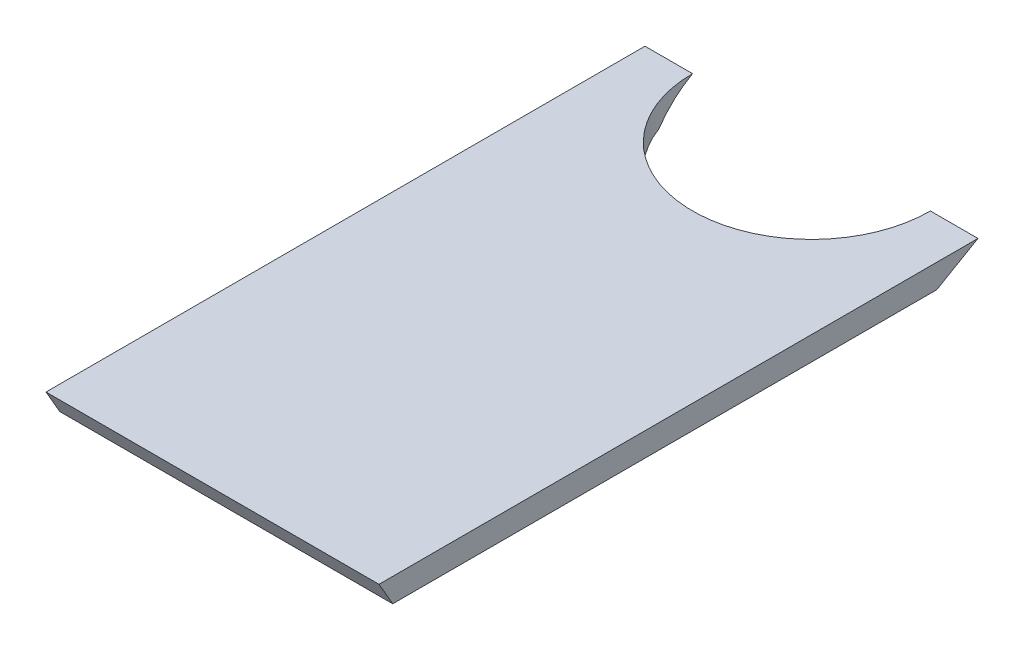
ISO-10303-21;
HEADER;
FILE_DESCRIPTION(('STEP AP214'),'2;1');
FILE_NAME('part.step','',(''),(''),'','','');
FILE_SCHEMA(('AUTOMOTIVE_DESIGN { 1 0 10303 214 1 1 1 1 }'));
ENDSEC;
DATA;
#1=APPLICATION_CONTEXT('core data for automotive mechanical design processes');
#2=APPLICATION_PROTOCOL_DEFINITION('international standard','automotive_design',2000,#1);
#3=PRODUCT_CONTEXT('',#1,'mechanical');
#4=PRODUCT('Part','Part','',(#3));
#5=PRODUCT_RELATED_PRODUCT_CATEGORY('part','',(#4));
#6=PRODUCT_DEFINITION_FORMATION('','',#4);
#7=PRODUCT_DEFINITION_CONTEXT('part definition',#1,'design');
#8=PRODUCT_DEFINITION('design','',#6,#7);
#9=PRODUCT_DEFINITION_SHAPE('','',#8);
#10=(LENGTH_UNIT() NAMED_UNIT(*) SI_UNIT(.MILLI.,.METRE.));
#11=(NAMED_UNIT(*) PLANE_ANGLE_UNIT() SI_UNIT($,.RADIAN.));
#12=(NAMED_UNIT(*) SI_UNIT($,.STERADIAN.) SOLID_ANGLE_UNIT());
#13=UNCERTAINTY_MEASURE_WITH_UNIT(LENGTH_MEASURE(1.E-05),#10,'distance_accuracy_value','');
#14=(GEOMETRIC_REPRESENTATION_CONTEXT(3) GLOBAL_UNCERTAINTY_ASSIGNED_CONTEXT((#13)) GLOBAL_UNIT_ASSIGNED_CONTEXT((#10,
#11,#12)) REPRESENTATION_CONTEXT('',''));
#15=CARTESIAN_POINT('',(0.,0.,0.));
#16=DIRECTION('',(0.,0.,1.));
#17=DIRECTION('',(1.,0.,0.));
#18=AXIS2_PLACEMENT_3D('',#15,#16,#17);
#19=CARTESIAN_POINT('',(44.45,-28.3981155746347,-16.395659671494));
#20=DIRECTION('',(0.,-0.866025403784432,-0.500000000000012));
#21=DIRECTION('',(0.,0.500000000000012,-0.866025403784432));
#22=AXIS2_PLACEMENT_3D('',#19,#20,#21);
#23=PLANE('',#22);
#24=DIRECTION('',(-1.,0.,0.));
#25=VECTOR('',#24,1.);
#26=CARTESIAN_POINT('',(44.45,3.17499999999927,-71.0819000000025));
#27=LINE('',#26,#25);
#28=CARTESIAN_POINT('',(-31.75,3.17499999999959,-71.0819000000025));
#29=VERTEX_POINT('',#28);
#30=CARTESIAN_POINT('',(-44.45,3.17499999999927,-71.0819000000025));
#31=VERTEX_POINT('',#30);
#32=EDGE_CURVE('E108',#29,#31,#27,.T.);
#33=ORIENTED_EDGE('',*,*,#32,.F.);
#34=CARTESIAN_POINT('',(0.,3.17499999999928,-71.0819000000025));
#35=DIRECTION('',(0.,-0.866025403784432,-0.500000000000012));
#36=DIRECTION('',(0.,0.500000000000012,-0.866025403784432));
#37=AXIS2_PLACEMENT_3D('',#34,#35,#36);
#38=ELLIPSE('',#37,36.6617420935415,31.75);
#39=CARTESIAN_POINT('',(-29.7841400748793,-3.17500000000003,-60.0833773719417));
#40=VERTEX_POINT('',#39);
#41=EDGE_CURVE('E96',#29,#40,#38,.F.);
#42=ORIENTED_EDGE('',*,*,#41,.T.);
#43=DIRECTION('',(-1.,0.,0.));
#44=VECTOR('',#43,1.);
#45=CARTESIAN_POINT('',(44.45,-3.17500000000003,-60.0833773719417));
#46=LINE('',#45,#44);
#47=CARTESIAN_POINT('',(-44.45,-3.17500000000003,-60.0833773719417));
#48=VERTEX_POINT('',#47);
#49=EDGE_CURVE('E79',#40,#48,#46,.T.);
#50=ORIENTED_EDGE('',*,*,#49,.T.);
#51=DIRECTION('',(0.,-0.500000000000012,0.866025403784432));
#52=VECTOR('',#51,1.);
#53=CARTESIAN_POINT('',(-44.45,-28.3981155746347,-16.395659671494));
#54=LINE('',#53,#52);
#55=EDGE_CURVE('E124',#31,#48,#54,.T.);
#56=ORIENTED_EDGE('',*,*,#55,.F.);
#57=EDGE_LOOP('',(#33,#42,#50,#56));
#58=FACE_BOUND('',#57,.T.);
#59=ADVANCED_FACE('F35',(#58),#23,.T.);
#60=CARTESIAN_POINT('',(44.45,-3.17500000000003,-60.0833773719417));
#61=VERTEX_POINT('',#60);
#62=CARTESIAN_POINT('',(29.7841400748794,-3.17500000000003,-60.0833773719417));
#63=VERTEX_POINT('',#62);
#64=EDGE_CURVE('E102',#61,#63,#46,.T.);
#65=ORIENTED_EDGE('',*,*,#64,.T.);
#66=CARTESIAN_POINT('',(31.75,3.17499999999959,-71.0819000000025));
#67=VERTEX_POINT('',#66);
#68=EDGE_CURVE('E48',#63,#67,#38,.F.);
#69=ORIENTED_EDGE('',*,*,#68,.T.);
#70=CARTESIAN_POINT('',(44.45,3.17499999999927,-71.0819000000025));
#71=VERTEX_POINT('',#70);
#72=EDGE_CURVE('E42',#71,#67,#27,.T.);
#73=ORIENTED_EDGE('',*,*,#72,.F.);
#74=DIRECTION('',(0.,-0.500000000000012,0.866025403784432));
#75=VECTOR('',#74,1.);
#76=CARTESIAN_POINT('',(44.45,-28.3981155746347,-16.395659671494));
#77=LINE('',#76,#75);
#78=EDGE_CURVE('E118',#71,#61,#77,.T.);
#79=ORIENTED_EDGE('',*,*,#78,.T.);
#80=EDGE_LOOP('',(#65,#69,#73,#79));
#81=FACE_BOUND('',#80,.T.);
#82=ADVANCED_FACE('F101',(#81),#23,.T.);
#83=CARTESIAN_POINT('',(44.45,3.17499999999959,0.));
#84=DIRECTION('',(0.,1.,0.));
#85=DIRECTION('',(0.,0.,1.));
#86=AXIS2_PLACEMENT_3D('',#83,#84,#85);
#87=PLANE('',#86);
#88=ORIENTED_EDGE('',*,*,#72,.T.);
#89=CARTESIAN_POINT('',(0.,3.17499999999959,-71.0819000000025));
#90=DIRECTION('',(0.,1.,0.));
#91=DIRECTION('',(0.,0.,1.));
#92=AXIS2_PLACEMENT_3D('',#89,#90,#91);
#93=CIRCLE('',#92,31.75);
#94=EDGE_CURVE('E94',#67,#29,#93,.F.);
#95=ORIENTED_EDGE('',*,*,#94,.T.);
#96=ORIENTED_EDGE('',*,*,#32,.T.);
#97=DIRECTION('',(0.,0.,-1.));
#98=VECTOR('',#97,1.);
#99=CARTESIAN_POINT('',(-44.45,3.17499999999959,0.));
#100=LINE('',#99,#98);
#101=CARTESIAN_POINT('',(-44.45,3.175,88.8254705950055));
#102=VERTEX_POINT('',#101);
#103=EDGE_CURVE('E121',#102,#31,#100,.T.);
#104=ORIENTED_EDGE('',*,*,#103,.F.);
#105=DIRECTION('',(-1.,0.,0.));
#106=VECTOR('',#105,1.);
#107=CARTESIAN_POINT('',(44.45,3.175,88.8254705950055));
#108=LINE('',#107,#106);
#109=CARTESIAN_POINT('',(44.45,3.175,88.8254705950055));
#110=VERTEX_POINT('',#109);
#111=EDGE_CURVE('E109',#110,#102,#108,.T.);
#112=ORIENTED_EDGE('',*,*,#111,.F.);
#113=DIRECTION('',(0.,0.,-1.));
#114=VECTOR('',#113,1.);
#115=CARTESIAN_POINT('',(44.45,3.17499999999959,0.));
#116=LINE('',#115,#114);
#117=EDGE_CURVE('E107',#110,#71,#116,.T.);
#118=ORIENTED_EDGE('',*,*,#117,.T.);
#119=EDGE_LOOP('',(#88,#95,#96,#104,#112,#118));
#120=FACE_BOUND('',#119,.T.);
#121=ADVANCED_FACE('F105',(#120),#87,.T.);
#122=CARTESIAN_POINT('',(44.45,-3.17500000000003,0.));
#123=DIRECTION('',(0.,1.,0.));
#124=DIRECTION('',(0.,0.,1.));
#125=AXIS2_PLACEMENT_3D('',#122,#123,#124);
#126=PLANE('',#125);
#127=CARTESIAN_POINT('',(0.,-3.17500000000003,-71.0819000000025));
#128=DIRECTION('',(0.,1.,0.));
#129=DIRECTION('',(0.,0.,1.));
#130=AXIS2_PLACEMENT_3D('',#127,#128,#129);
#131=CIRCLE('',#130,31.75);
#132=EDGE_CURVE('E11',#63,#40,#131,.F.);
#133=ORIENTED_EDGE('',*,*,#132,.F.);
#134=ORIENTED_EDGE('',*,*,#64,.F.);
#135=DIRECTION('',(0.,0.,-1.));
#136=VECTOR('',#135,1.);
#137=CARTESIAN_POINT('',(44.45,-3.17500000000003,0.));
#138=LINE('',#137,#136);
#139=CARTESIAN_POINT('',(44.45,-3.17500000000003,85.1592963856514));
#140=VERTEX_POINT('',#139);
#141=EDGE_CURVE('E57',#140,#61,#138,.T.);
#142=ORIENTED_EDGE('',*,*,#141,.F.);
#143=DIRECTION('',(-1.,0.,0.));
#144=VECTOR('',#143,1.);
#145=CARTESIAN_POINT('',(44.45,-3.17500000000003,85.1592963856514));
#146=LINE('',#145,#144);
#147=CARTESIAN_POINT('',(-44.45,-3.17500000000003,85.1592963856514));
#148=VERTEX_POINT('',#147);
#149=EDGE_CURVE('E112',#140,#148,#146,.T.);
#150=ORIENTED_EDGE('',*,*,#149,.T.);
#151=DIRECTION('',(0.,0.,-1.));
#152=VECTOR('',#151,1.);
#153=CARTESIAN_POINT('',(-44.45,-3.17500000000003,0.));
#154=LINE('',#153,#152);
#155=EDGE_CURVE('E116',#148,#48,#154,.T.);
#156=ORIENTED_EDGE('',*,*,#155,.T.);
#157=ORIENTED_EDGE('',*,*,#49,.F.);
#158=EDGE_LOOP('',(#133,#134,#142,#150,#156,#157));
#159=FACE_BOUND('',#158,.T.);
#160=ADVANCED_FACE('F139',(#159),#126,.F.);
#161=CARTESIAN_POINT('',(44.45,-37.6688070191912,65.2442876177463));
#162=DIRECTION('',(0.,0.5,-0.866025403784438));
#163=DIRECTION('',(0.,0.866025403784439,0.5));
#164=AXIS2_PLACEMENT_3D('',#161,#162,#163);
#165=PLANE('',#164);
#166=DIRECTION('',(0.,-0.866025403784438,-0.5));
#167=VECTOR('',#166,1.);
#168=CARTESIAN_POINT('',(-44.45,-37.6688070191912,65.2442876177463));
#169=LINE('',#168,#167);
#170=EDGE_CURVE('E119',#102,#148,#169,.T.);
#171=ORIENTED_EDGE('',*,*,#170,.T.);
#172=ORIENTED_EDGE('',*,*,#149,.F.);
#173=DIRECTION('',(0.,-0.866025403784438,-0.5));
#174=VECTOR('',#173,1.);
#175=CARTESIAN_POINT('',(44.45,-37.6688070191912,65.2442876177463));
#176=LINE('',#175,#174);
#177=EDGE_CURVE('E128',#110,#140,#176,.T.);
#178=ORIENTED_EDGE('',*,*,#177,.F.);
#179=ORIENTED_EDGE('',*,*,#111,.T.);
#180=EDGE_LOOP('',(#171,#172,#178,#179));
#181=FACE_BOUND('',#180,.T.);
#182=ADVANCED_FACE('F135',(#181),#165,.F.);
#183=CARTESIAN_POINT('',(44.45,0.,0.));
#184=DIRECTION('',(1.,0.,0.));
#185=DIRECTION('',(0.,0.,-1.));
#186=AXIS2_PLACEMENT_3D('',#183,#184,#185);
#187=PLANE('',#186);
#188=ORIENTED_EDGE('',*,*,#78,.F.);
#189=ORIENTED_EDGE('',*,*,#117,.F.);
#190=ORIENTED_EDGE('',*,*,#177,.T.);
#191=ORIENTED_EDGE('',*,*,#141,.T.);
#192=EDGE_LOOP('',(#188,#189,#190,#191));
#193=FACE_BOUND('',#192,.T.);
#194=ADVANCED_FACE('F131',(#193),#187,.T.);
#195=CARTESIAN_POINT('',(-44.45,0.,0.));
#196=DIRECTION('',(1.,0.,0.));
#197=DIRECTION('',(0.,0.,-1.));
#198=AXIS2_PLACEMENT_3D('',#195,#196,#197);
#199=PLANE('',#198);
#200=ORIENTED_EDGE('',*,*,#55,.T.);
#201=ORIENTED_EDGE('',*,*,#155,.F.);
#202=ORIENTED_EDGE('',*,*,#170,.F.);
#203=ORIENTED_EDGE('',*,*,#103,.T.);
#204=EDGE_LOOP('',(#200,#201,#202,#203));
#205=FACE_BOUND('',#204,.T.);
#206=ADVANCED_FACE('F142',(#205),#199,.F.);
#207=CARTESIAN_POINT('',(0.,-3.17500000000003,-71.0819000000025));
#208=DIRECTION('',(0.,1.,0.));
#209=DIRECTION('',(0.,0.,1.));
#210=AXIS2_PLACEMENT_3D('',#207,#208,#209);
#211=CYLINDRICAL_SURFACE('',#210,31.75);
#212=ORIENTED_EDGE('',*,*,#94,.F.);
#213=ORIENTED_EDGE('',*,*,#68,.F.);
#214=ORIENTED_EDGE('',*,*,#132,.T.);
#215=ORIENTED_EDGE('',*,*,#41,.F.);
#216=EDGE_LOOP('',(#212,#213,#214,#215));
#217=FACE_BOUND('',#216,.T.);
#218=ADVANCED_FACE('F95',(#217),#211,.F.);
#219=CLOSED_SHELL('',(#59,#82,#121,#160,#182,#194,#206,#218));
#220=MANIFOLD_SOLID_BREP('B2',#219);
#221=ADVANCED_BREP_SHAPE_REPRESENTATION('',(#18,#220),#14);
#222=SHAPE_DEFINITION_REPRESENTATION(#9,#221);
ENDSEC;
END-ISO-10303-21;
